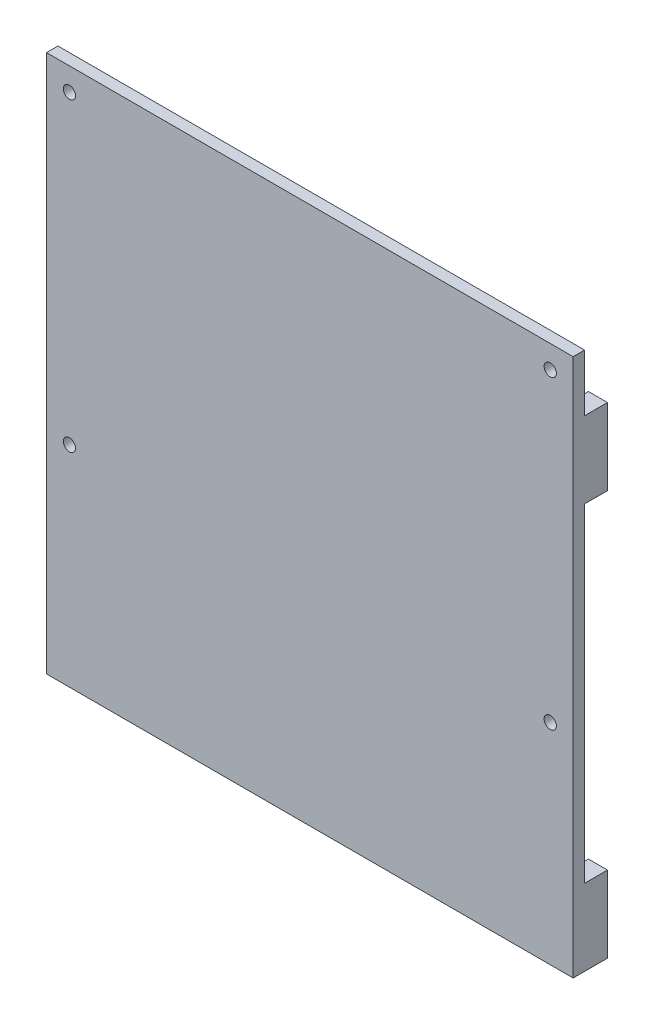
ISO-10303-21;
HEADER;
FILE_DESCRIPTION(('STEP AP214'),'2;1');
FILE_NAME('part.step','',(''),(''),'','','');
FILE_SCHEMA(('AUTOMOTIVE_DESIGN { 1 0 10303 214 1 1 1 1 }'));
ENDSEC;
DATA;
#1=APPLICATION_CONTEXT('core data for automotive mechanical design processes');
#2=APPLICATION_PROTOCOL_DEFINITION('international standard','automotive_design',2000,#1);
#3=PRODUCT_CONTEXT('',#1,'mechanical');
#4=PRODUCT('Part','Part','',(#3));
#5=PRODUCT_RELATED_PRODUCT_CATEGORY('part','',(#4));
#6=PRODUCT_DEFINITION_FORMATION('','',#4);
#7=PRODUCT_DEFINITION_CONTEXT('part definition',#1,'design');
#8=PRODUCT_DEFINITION('design','',#6,#7);
#9=PRODUCT_DEFINITION_SHAPE('','',#8);
#10=(LENGTH_UNIT() NAMED_UNIT(*) SI_UNIT(.MILLI.,.METRE.));
#11=(NAMED_UNIT(*) PLANE_ANGLE_UNIT() SI_UNIT($,.RADIAN.));
#12=(NAMED_UNIT(*) SI_UNIT($,.STERADIAN.) SOLID_ANGLE_UNIT());
#13=UNCERTAINTY_MEASURE_WITH_UNIT(LENGTH_MEASURE(1.E-05),#10,'distance_accuracy_value','');
#14=(GEOMETRIC_REPRESENTATION_CONTEXT(3) GLOBAL_UNCERTAINTY_ASSIGNED_CONTEXT((#13)) GLOBAL_UNIT_ASSIGNED_CONTEXT((#10,
#11,#12)) REPRESENTATION_CONTEXT('',''));
#15=CARTESIAN_POINT('',(0.,0.,0.));
#16=DIRECTION('',(0.,0.,1.));
#17=DIRECTION('',(1.,0.,0.));
#18=AXIS2_PLACEMENT_3D('',#15,#16,#17);
#19=CARTESIAN_POINT('',(0.,0.,0.));
#20=DIRECTION('',(0.,0.,1.));
#21=DIRECTION('',(1.,0.,0.));
#22=AXIS2_PLACEMENT_3D('',#19,#20,#21);
#23=PLANE('',#22);
#24=CARTESIAN_POINT('',(-48.1611570247934,18.3756022572227,0.));
#25=DIRECTION('',(0.,0.,1.));
#26=DIRECTION('',(1.,0.,0.));
#27=AXIS2_PLACEMENT_3D('',#24,#25,#26);
#28=CIRCLE('',#27,1.6);
#29=CARTESIAN_POINT('',(-46.5611570247934,18.3756022572227,0.));
#30=VERTEX_POINT('',#29);
#31=EDGE_CURVE('E341',#30,#30,#28,.T.);
#32=ORIENTED_EDGE('',*,*,#31,.T.);
#33=EDGE_LOOP('',(#32));
#34=FACE_BOUND('',#33,.T.);
#35=CARTESIAN_POINT('',(77.8388429752066,18.3756022572227,0.));
#36=DIRECTION('',(0.,0.,1.));
#37=DIRECTION('',(1.,0.,0.));
#38=AXIS2_PLACEMENT_3D('',#35,#36,#37);
#39=CIRCLE('',#38,1.6);
#40=CARTESIAN_POINT('',(79.4388429752066,18.3756022572227,0.));
#41=VERTEX_POINT('',#40);
#42=EDGE_CURVE('E333',#41,#41,#39,.T.);
#43=ORIENTED_EDGE('',*,*,#42,.T.);
#44=EDGE_LOOP('',(#43));
#45=FACE_BOUND('',#44,.T.);
#46=CARTESIAN_POINT('',(-48.1611570247934,-61.6243977427773,0.));
#47=DIRECTION('',(0.,0.,1.));
#48=DIRECTION('',(1.,0.,0.));
#49=AXIS2_PLACEMENT_3D('',#46,#47,#48);
#50=CIRCLE('',#49,1.6);
#51=CARTESIAN_POINT('',(-46.5611570247934,-61.6243977427773,0.));
#52=VERTEX_POINT('',#51);
#53=EDGE_CURVE('E325',#52,#52,#50,.T.);
#54=ORIENTED_EDGE('',*,*,#53,.T.);
#55=EDGE_LOOP('',(#54));
#56=FACE_BOUND('',#55,.T.);
#57=CARTESIAN_POINT('',(77.8388429752066,-61.6243977427773,0.));
#58=DIRECTION('',(0.,0.,1.));
#59=DIRECTION('',(1.,0.,0.));
#60=AXIS2_PLACEMENT_3D('',#57,#58,#59);
#61=CIRCLE('',#60,1.60000000000001);
#62=CARTESIAN_POINT('',(79.4388429752066,-61.6243977427773,0.));
#63=VERTEX_POINT('',#62);
#64=EDGE_CURVE('E320',#63,#63,#61,.T.);
#65=ORIENTED_EDGE('',*,*,#64,.T.);
#66=EDGE_LOOP('',(#65));
#67=FACE_BOUND('',#66,.T.);
#68=DIRECTION('',(1.,0.,0.));
#69=VECTOR('',#68,1.);
#70=CARTESIAN_POINT('',(83.8388429752066,9.4652357950889,0.));
#71=LINE('',#70,#69);
#72=CARTESIAN_POINT('',(78.8388429752066,9.4652357950889,0.));
#73=VERTEX_POINT('',#72);
#74=CARTESIAN_POINT('',(83.8388429752066,9.4652357950889,0.));
#75=VERTEX_POINT('',#74);
#76=EDGE_CURVE('E61',#73,#75,#71,.T.);
#77=ORIENTED_EDGE('',*,*,#76,.F.);
#78=DIRECTION('',(0.,1.,0.));
#79=VECTOR('',#78,1.);
#80=CARTESIAN_POINT('',(78.8388429752066,9.4652357950889,0.));
#81=LINE('',#80,#79);
#82=CARTESIAN_POINT('',(78.8388429752066,-10.5347642049111,0.));
#83=VERTEX_POINT('',#82);
#84=EDGE_CURVE('E236',#83,#73,#81,.T.);
#85=ORIENTED_EDGE('',*,*,#84,.F.);
#86=DIRECTION('',(-1.,0.,0.));
#87=VECTOR('',#86,1.);
#88=CARTESIAN_POINT('',(83.8388429752066,-10.5347642049111,0.));
#89=LINE('',#88,#87);
#90=CARTESIAN_POINT('',(83.8388429752066,-10.5347642049111,0.));
#91=VERTEX_POINT('',#90);
#92=EDGE_CURVE('E240',#91,#83,#89,.T.);
#93=ORIENTED_EDGE('',*,*,#92,.F.);
#94=DIRECTION('',(0.,1.,0.));
#95=VECTOR('',#94,1.);
#96=CARTESIAN_POINT('',(83.8388429752066,24.3756022572227,0.));
#97=LINE('',#96,#95);
#98=CARTESIAN_POINT('',(83.8388429752066,-96.6243977427773,0.));
#99=VERTEX_POINT('',#98);
#100=EDGE_CURVE('E378',#99,#91,#97,.T.);
#101=ORIENTED_EDGE('',*,*,#100,.F.);
#102=DIRECTION('',(1.,0.,0.));
#103=VECTOR('',#102,1.);
#104=CARTESIAN_POINT('',(83.8388429752066,-96.6243977427773,0.));
#105=LINE('',#104,#103);
#106=CARTESIAN_POINT('',(78.8388429752066,-96.6243977427773,0.));
#107=VERTEX_POINT('',#106);
#108=EDGE_CURVE('E293',#107,#99,#105,.T.);
#109=ORIENTED_EDGE('',*,*,#108,.F.);
#110=DIRECTION('',(0.,1.,0.));
#111=VECTOR('',#110,1.);
#112=CARTESIAN_POINT('',(78.8388429752066,-96.6243977427773,0.));
#113=LINE('',#112,#111);
#114=CARTESIAN_POINT('',(78.8388429752066,-116.624397742777,0.));
#115=VERTEX_POINT('',#114);
#116=EDGE_CURVE('E244',#115,#107,#113,.T.);
#117=ORIENTED_EDGE('',*,*,#116,.F.);
#118=DIRECTION('',(1.,0.,0.));
#119=VECTOR('',#118,1.);
#120=CARTESIAN_POINT('',(-54.1611570247934,-116.624397742777,0.));
#121=LINE('',#120,#119);
#122=CARTESIAN_POINT('',(-49.1611570247934,-116.624397742777,0.));
#123=VERTEX_POINT('',#122);
#124=EDGE_CURVE('E371',#123,#115,#121,.T.);
#125=ORIENTED_EDGE('',*,*,#124,.F.);
#126=DIRECTION('',(0.,-1.,0.));
#127=VECTOR('',#126,1.);
#128=CARTESIAN_POINT('',(-49.1611570247934,-96.6243977427773,0.));
#129=LINE('',#128,#127);
#130=CARTESIAN_POINT('',(-49.1611570247934,-96.6243977427773,0.));
#131=VERTEX_POINT('',#130);
#132=EDGE_CURVE('E268',#131,#123,#129,.T.);
#133=ORIENTED_EDGE('',*,*,#132,.F.);
#134=DIRECTION('',(1.,0.,0.));
#135=VECTOR('',#134,1.);
#136=CARTESIAN_POINT('',(-54.1611570247934,-96.6243977427773,0.));
#137=LINE('',#136,#135);
#138=CARTESIAN_POINT('',(-54.1611570247934,-96.6243977427773,0.));
#139=VERTEX_POINT('',#138);
#140=EDGE_CURVE('E221',#139,#131,#137,.T.);
#141=ORIENTED_EDGE('',*,*,#140,.F.);
#142=DIRECTION('',(0.,-1.,0.));
#143=VECTOR('',#142,1.);
#144=CARTESIAN_POINT('',(-54.1611570247934,24.3756022572227,0.));
#145=LINE('',#144,#143);
#146=CARTESIAN_POINT('',(-54.1611570247934,-10.5347642049111,0.));
#147=VERTEX_POINT('',#146);
#148=EDGE_CURVE('E349',#147,#139,#145,.T.);
#149=ORIENTED_EDGE('',*,*,#148,.F.);
#150=DIRECTION('',(-1.,0.,0.));
#151=VECTOR('',#150,1.);
#152=CARTESIAN_POINT('',(-54.1611570247934,-10.5347642049111,0.));
#153=LINE('',#152,#151);
#154=CARTESIAN_POINT('',(-49.1611570247934,-10.5347642049111,0.));
#155=VERTEX_POINT('',#154);
#156=EDGE_CURVE('E68',#155,#147,#153,.T.);
#157=ORIENTED_EDGE('',*,*,#156,.F.);
#158=DIRECTION('',(0.,-1.,0.));
#159=VECTOR('',#158,1.);
#160=CARTESIAN_POINT('',(-49.1611570247934,9.46523579508891,0.));
#161=LINE('',#160,#159);
#162=CARTESIAN_POINT('',(-49.1611570247934,9.46523579508891,0.));
#163=VERTEX_POINT('',#162);
#164=EDGE_CURVE('E166',#163,#155,#161,.T.);
#165=ORIENTED_EDGE('',*,*,#164,.F.);
#166=DIRECTION('',(1.,0.,0.));
#167=VECTOR('',#166,1.);
#168=CARTESIAN_POINT('',(-54.1611570247934,9.46523579508892,0.));
#169=LINE('',#168,#167);
#170=CARTESIAN_POINT('',(-54.1611570247934,9.46523579508892,0.));
#171=VERTEX_POINT('',#170);
#172=EDGE_CURVE('E169',#171,#163,#169,.T.);
#173=ORIENTED_EDGE('',*,*,#172,.F.);
#174=CARTESIAN_POINT('',(-54.1611570247934,24.3756022572227,0.));
#175=VERTEX_POINT('',#174);
#176=EDGE_CURVE('E368',#175,#171,#145,.T.);
#177=ORIENTED_EDGE('',*,*,#176,.F.);
#178=DIRECTION('',(-1.,0.,0.));
#179=VECTOR('',#178,1.);
#180=CARTESIAN_POINT('',(-54.1611570247934,24.3756022572227,0.));
#181=LINE('',#180,#179);
#182=CARTESIAN_POINT('',(83.8388429752066,24.3756022572227,0.));
#183=VERTEX_POINT('',#182);
#184=EDGE_CURVE('E358',#183,#175,#181,.T.);
#185=ORIENTED_EDGE('',*,*,#184,.F.);
#186=EDGE_CURVE('E375',#75,#183,#97,.T.);
#187=ORIENTED_EDGE('',*,*,#186,.F.);
#188=EDGE_LOOP('',(#77,#85,#93,#101,#109,#117,#125,#133,#141,#149,#157,#165,#173,#177,#185,#187));
#189=FACE_BOUND('',#188,.T.);
#190=ADVANCED_FACE('F45',(#34,#45,#56,#67,#189),#23,.F.);
#191=CARTESIAN_POINT('',(0.,0.,3.));
#192=DIRECTION('',(0.,0.,1.));
#193=DIRECTION('',(1.,0.,0.));
#194=AXIS2_PLACEMENT_3D('',#191,#192,#193);
#195=PLANE('',#194);
#196=CARTESIAN_POINT('',(-48.1611570247934,-61.6243977427773,3.));
#197=DIRECTION('',(0.,0.,1.));
#198=DIRECTION('',(1.,0.,0.));
#199=AXIS2_PLACEMENT_3D('',#196,#197,#198);
#200=CIRCLE('',#199,1.6);
#201=CARTESIAN_POINT('',(-46.5611570247934,-61.6243977427773,3.));
#202=VERTEX_POINT('',#201);
#203=EDGE_CURVE('E329',#202,#202,#200,.T.);
#204=ORIENTED_EDGE('',*,*,#203,.F.);
#205=EDGE_LOOP('',(#204));
#206=FACE_BOUND('',#205,.T.);
#207=CARTESIAN_POINT('',(-48.1611570247934,18.3756022572227,3.));
#208=DIRECTION('',(0.,0.,1.));
#209=DIRECTION('',(1.,0.,0.));
#210=AXIS2_PLACEMENT_3D('',#207,#208,#209);
#211=CIRCLE('',#210,1.6);
#212=CARTESIAN_POINT('',(-46.5611570247934,18.3756022572227,3.));
#213=VERTEX_POINT('',#212);
#214=EDGE_CURVE('E345',#213,#213,#211,.T.);
#215=ORIENTED_EDGE('',*,*,#214,.F.);
#216=EDGE_LOOP('',(#215));
#217=FACE_BOUND('',#216,.T.);
#218=DIRECTION('',(0.,-1.,0.));
#219=VECTOR('',#218,1.);
#220=CARTESIAN_POINT('',(-54.1611570247934,24.3756022572227,3.));
#221=LINE('',#220,#219);
#222=CARTESIAN_POINT('',(-54.1611570247934,24.3756022572227,3.));
#223=VERTEX_POINT('',#222);
#224=CARTESIAN_POINT('',(-54.1611570247934,-116.624397742777,3.));
#225=VERTEX_POINT('',#224);
#226=EDGE_CURVE('E353',#223,#225,#221,.T.);
#227=ORIENTED_EDGE('',*,*,#226,.T.);
#228=DIRECTION('',(1.,0.,0.));
#229=VECTOR('',#228,1.);
#230=CARTESIAN_POINT('',(-54.1611570247934,-116.624397742777,3.));
#231=LINE('',#230,#229);
#232=CARTESIAN_POINT('',(83.8388429752066,-116.624397742777,3.));
#233=VERTEX_POINT('',#232);
#234=EDGE_CURVE('E357',#225,#233,#231,.T.);
#235=ORIENTED_EDGE('',*,*,#234,.T.);
#236=DIRECTION('',(0.,1.,0.));
#237=VECTOR('',#236,1.);
#238=CARTESIAN_POINT('',(83.8388429752066,24.3756022572227,3.));
#239=LINE('',#238,#237);
#240=CARTESIAN_POINT('',(83.8388429752066,24.3756022572227,3.));
#241=VERTEX_POINT('',#240);
#242=EDGE_CURVE('E361',#233,#241,#239,.T.);
#243=ORIENTED_EDGE('',*,*,#242,.T.);
#244=DIRECTION('',(-1.,0.,0.));
#245=VECTOR('',#244,1.);
#246=CARTESIAN_POINT('',(-54.1611570247934,24.3756022572227,3.));
#247=LINE('',#246,#245);
#248=EDGE_CURVE('E364',#241,#223,#247,.T.);
#249=ORIENTED_EDGE('',*,*,#248,.T.);
#250=EDGE_LOOP('',(#227,#235,#243,#249));
#251=FACE_BOUND('',#250,.T.);
#252=CARTESIAN_POINT('',(77.8388429752066,18.3756022572227,3.));
#253=DIRECTION('',(0.,0.,1.));
#254=DIRECTION('',(1.,0.,0.));
#255=AXIS2_PLACEMENT_3D('',#252,#253,#254);
#256=CIRCLE('',#255,1.6);
#257=CARTESIAN_POINT('',(79.4388429752066,18.3756022572227,3.));
#258=VERTEX_POINT('',#257);
#259=EDGE_CURVE('E337',#258,#258,#256,.T.);
#260=ORIENTED_EDGE('',*,*,#259,.F.);
#261=EDGE_LOOP('',(#260));
#262=FACE_BOUND('',#261,.T.);
#263=CARTESIAN_POINT('',(77.8388429752066,-61.6243977427773,3.));
#264=DIRECTION('',(0.,0.,1.));
#265=DIRECTION('',(1.,0.,0.));
#266=AXIS2_PLACEMENT_3D('',#263,#264,#265);
#267=CIRCLE('',#266,1.60000000000001);
#268=CARTESIAN_POINT('',(79.4388429752066,-61.6243977427773,3.));
#269=VERTEX_POINT('',#268);
#270=EDGE_CURVE('E321',#269,#269,#267,.T.);
#271=ORIENTED_EDGE('',*,*,#270,.F.);
#272=EDGE_LOOP('',(#271));
#273=FACE_BOUND('',#272,.T.);
#274=ADVANCED_FACE('F433',(#206,#217,#251,#262,#273),#195,.T.);
#275=CARTESIAN_POINT('',(-54.1611570247934,24.3756022572227,3.));
#276=DIRECTION('',(1.,0.,0.));
#277=DIRECTION('',(0.,1.,0.));
#278=AXIS2_PLACEMENT_3D('',#275,#276,#277);
#279=PLANE('',#278);
#280=ORIENTED_EDGE('',*,*,#176,.T.);
#281=DIRECTION('',(0.,0.,1.));
#282=VECTOR('',#281,1.);
#283=CARTESIAN_POINT('',(-54.1611570247934,9.46523579508892,-6.));
#284=LINE('',#283,#282);
#285=CARTESIAN_POINT('',(-54.1611570247934,9.46523579508892,-6.));
#286=VERTEX_POINT('',#285);
#287=EDGE_CURVE('E184',#286,#171,#284,.T.);
#288=ORIENTED_EDGE('',*,*,#287,.F.);
#289=DIRECTION('',(0.,1.,0.));
#290=VECTOR('',#289,1.);
#291=CARTESIAN_POINT('',(-54.1611570247934,9.46523579508892,-6.));
#292=LINE('',#291,#290);
#293=CARTESIAN_POINT('',(-54.1611570247934,-10.5347642049111,-6.));
#294=VERTEX_POINT('',#293);
#295=EDGE_CURVE('E204',#294,#286,#292,.T.);
#296=ORIENTED_EDGE('',*,*,#295,.F.);
#297=DIRECTION('',(0.,0.,1.));
#298=VECTOR('',#297,1.);
#299=CARTESIAN_POINT('',(-54.1611570247934,-10.5347642049111,-6.));
#300=LINE('',#299,#298);
#301=EDGE_CURVE('E195',#294,#147,#300,.T.);
#302=ORIENTED_EDGE('',*,*,#301,.T.);
#303=ORIENTED_EDGE('',*,*,#148,.T.);
#304=DIRECTION('',(0.,0.,1.));
#305=VECTOR('',#304,1.);
#306=CARTESIAN_POINT('',(-54.1611570247934,-96.6243977427773,-6.));
#307=LINE('',#306,#305);
#308=CARTESIAN_POINT('',(-54.1611570247934,-96.6243977427773,-6.));
#309=VERTEX_POINT('',#308);
#310=EDGE_CURVE('E186',#309,#139,#307,.T.);
#311=ORIENTED_EDGE('',*,*,#310,.F.);
#312=DIRECTION('',(0.,1.,0.));
#313=VECTOR('',#312,1.);
#314=CARTESIAN_POINT('',(-54.1611570247934,-96.6243977427773,-6.));
#315=LINE('',#314,#313);
#316=CARTESIAN_POINT('',(-54.1611570247934,-116.624397742777,-6.));
#317=VERTEX_POINT('',#316);
#318=EDGE_CURVE('E272',#317,#309,#315,.T.);
#319=ORIENTED_EDGE('',*,*,#318,.F.);
#320=DIRECTION('',(0.,0.,-1.));
#321=VECTOR('',#320,1.);
#322=CARTESIAN_POINT('',(-54.1611570247934,-116.624397742777,3.));
#323=LINE('',#322,#321);
#324=EDGE_CURVE('E11',#225,#317,#323,.T.);
#325=ORIENTED_EDGE('',*,*,#324,.F.);
#326=ORIENTED_EDGE('',*,*,#226,.F.);
#327=DIRECTION('',(0.,0.,-1.));
#328=VECTOR('',#327,1.);
#329=CARTESIAN_POINT('',(-54.1611570247934,24.3756022572227,3.));
#330=LINE('',#329,#328);
#331=EDGE_CURVE('E367',#223,#175,#330,.T.);
#332=ORIENTED_EDGE('',*,*,#331,.T.);
#333=EDGE_LOOP('',(#280,#288,#296,#302,#303,#311,#319,#325,#326,#332));
#334=FACE_BOUND('',#333,.T.);
#335=ADVANCED_FACE('F47',(#334),#279,.F.);
#336=CARTESIAN_POINT('',(-54.1611570247934,-116.624397742777,3.));
#337=DIRECTION('',(0.,1.,0.));
#338=DIRECTION('',(0.,0.,1.));
#339=AXIS2_PLACEMENT_3D('',#336,#337,#338);
#340=PLANE('',#339);
#341=ORIENTED_EDGE('',*,*,#324,.T.);
#342=DIRECTION('',(-1.,0.,0.));
#343=VECTOR('',#342,1.);
#344=CARTESIAN_POINT('',(-54.1611570247934,-116.624397742777,-6.));
#345=LINE('',#344,#343);
#346=CARTESIAN_POINT('',(-49.1611570247934,-116.624397742777,-6.));
#347=VERTEX_POINT('',#346);
#348=EDGE_CURVE('E267',#347,#317,#345,.T.);
#349=ORIENTED_EDGE('',*,*,#348,.F.);
#350=DIRECTION('',(0.,0.,1.));
#351=VECTOR('',#350,1.);
#352=CARTESIAN_POINT('',(-49.1611570247934,-116.624397742777,-6.));
#353=LINE('',#352,#351);
#354=EDGE_CURVE('E263',#347,#123,#353,.T.);
#355=ORIENTED_EDGE('',*,*,#354,.T.);
#356=ORIENTED_EDGE('',*,*,#124,.T.);
#357=DIRECTION('',(0.,0.,1.));
#358=VECTOR('',#357,1.);
#359=CARTESIAN_POINT('',(78.8388429752066,-116.624397742777,-6.));
#360=LINE('',#359,#358);
#361=CARTESIAN_POINT('',(78.8388429752066,-116.624397742777,-6.));
#362=VERTEX_POINT('',#361);
#363=EDGE_CURVE('E316',#362,#115,#360,.T.);
#364=ORIENTED_EDGE('',*,*,#363,.F.);
#365=DIRECTION('',(-1.,0.,0.));
#366=VECTOR('',#365,1.);
#367=CARTESIAN_POINT('',(83.8388429752066,-116.624397742777,-6.));
#368=LINE('',#367,#366);
#369=CARTESIAN_POINT('',(83.8388429752066,-116.624397742777,-6.));
#370=VERTEX_POINT('',#369);
#371=EDGE_CURVE('E292',#370,#362,#368,.T.);
#372=ORIENTED_EDGE('',*,*,#371,.F.);
#373=DIRECTION('',(0.,0.,-1.));
#374=VECTOR('',#373,1.);
#375=CARTESIAN_POINT('',(83.8388429752066,-116.624397742777,3.));
#376=LINE('',#375,#374);
#377=EDGE_CURVE('E54',#233,#370,#376,.T.);
#378=ORIENTED_EDGE('',*,*,#377,.F.);
#379=ORIENTED_EDGE('',*,*,#234,.F.);
#380=EDGE_LOOP('',(#341,#349,#355,#356,#364,#372,#378,#379));
#381=FACE_BOUND('',#380,.T.);
#382=ADVANCED_FACE('F397',(#381),#340,.F.);
#383=CARTESIAN_POINT('',(83.8388429752066,24.3756022572227,3.));
#384=DIRECTION('',(-1.,0.,0.));
#385=DIRECTION('',(0.,-1.,0.));
#386=AXIS2_PLACEMENT_3D('',#383,#384,#385);
#387=PLANE('',#386);
#388=ORIENTED_EDGE('',*,*,#377,.T.);
#389=DIRECTION('',(0.,-1.,0.));
#390=VECTOR('',#389,1.);
#391=CARTESIAN_POINT('',(83.8388429752066,-96.6243977427773,-6.));
#392=LINE('',#391,#390);
#393=CARTESIAN_POINT('',(83.8388429752066,-96.6243977427773,-6.));
#394=VERTEX_POINT('',#393);
#395=EDGE_CURVE('E288',#394,#370,#392,.T.);
#396=ORIENTED_EDGE('',*,*,#395,.F.);
#397=DIRECTION('',(0.,0.,1.));
#398=VECTOR('',#397,1.);
#399=CARTESIAN_POINT('',(83.8388429752066,-96.6243977427773,-6.));
#400=LINE('',#399,#398);
#401=EDGE_CURVE('E302',#394,#99,#400,.T.);
#402=ORIENTED_EDGE('',*,*,#401,.T.);
#403=ORIENTED_EDGE('',*,*,#100,.T.);
#404=DIRECTION('',(0.,0.,1.));
#405=VECTOR('',#404,1.);
#406=CARTESIAN_POINT('',(83.8388429752066,-10.5347642049111,-6.));
#407=LINE('',#406,#405);
#408=CARTESIAN_POINT('',(83.8388429752066,-10.5347642049111,-6.));
#409=VERTEX_POINT('',#408);
#410=EDGE_CURVE('E216',#409,#91,#407,.T.);
#411=ORIENTED_EDGE('',*,*,#410,.F.);
#412=DIRECTION('',(0.,-1.,0.));
#413=VECTOR('',#412,1.);
#414=CARTESIAN_POINT('',(83.8388429752066,9.4652357950889,-6.));
#415=LINE('',#414,#413);
#416=CARTESIAN_POINT('',(83.8388429752066,9.4652357950889,-6.));
#417=VERTEX_POINT('',#416);
#418=EDGE_CURVE('E237',#417,#409,#415,.T.);
#419=ORIENTED_EDGE('',*,*,#418,.F.);
#420=DIRECTION('',(0.,0.,1.));
#421=VECTOR('',#420,1.);
#422=CARTESIAN_POINT('',(83.8388429752066,9.4652357950889,-6.));
#423=LINE('',#422,#421);
#424=EDGE_CURVE('E229',#417,#75,#423,.T.);
#425=ORIENTED_EDGE('',*,*,#424,.T.);
#426=ORIENTED_EDGE('',*,*,#186,.T.);
#427=DIRECTION('',(0.,0.,-1.));
#428=VECTOR('',#427,1.);
#429=CARTESIAN_POINT('',(83.8388429752066,24.3756022572227,3.));
#430=LINE('',#429,#428);
#431=EDGE_CURVE('E384',#241,#183,#430,.T.);
#432=ORIENTED_EDGE('',*,*,#431,.F.);
#433=ORIENTED_EDGE('',*,*,#242,.F.);
#434=EDGE_LOOP('',(#388,#396,#402,#403,#411,#419,#425,#426,#432,#433));
#435=FACE_BOUND('',#434,.T.);
#436=ADVANCED_FACE('F393',(#435),#387,.F.);
#437=CARTESIAN_POINT('',(-54.1611570247934,24.3756022572227,3.));
#438=DIRECTION('',(0.,-1.,0.));
#439=DIRECTION('',(0.,0.,-1.));
#440=AXIS2_PLACEMENT_3D('',#437,#438,#439);
#441=PLANE('',#440);
#442=ORIENTED_EDGE('',*,*,#184,.T.);
#443=ORIENTED_EDGE('',*,*,#331,.F.);
#444=ORIENTED_EDGE('',*,*,#248,.F.);
#445=ORIENTED_EDGE('',*,*,#431,.T.);
#446=EDGE_LOOP('',(#442,#443,#444,#445));
#447=FACE_BOUND('',#446,.T.);
#448=ADVANCED_FACE('F446',(#447),#441,.F.);
#449=CARTESIAN_POINT('',(-48.1611570247934,18.3756022572227,3.));
#450=DIRECTION('',(0.,0.,-1.));
#451=DIRECTION('',(-1.,0.,0.));
#452=AXIS2_PLACEMENT_3D('',#449,#450,#451);
#453=CYLINDRICAL_SURFACE('',#452,1.6);
#454=ORIENTED_EDGE('',*,*,#214,.T.);
#455=EDGE_LOOP('',(#454));
#456=FACE_BOUND('',#455,.T.);
#457=ORIENTED_EDGE('',*,*,#31,.F.);
#458=EDGE_LOOP('',(#457));
#459=FACE_BOUND('',#458,.T.);
#460=ADVANCED_FACE('F449',(#456,#459),#453,.F.);
#461=CARTESIAN_POINT('',(77.8388429752066,18.3756022572227,3.));
#462=DIRECTION('',(0.,0.,-1.));
#463=DIRECTION('',(-1.,0.,0.));
#464=AXIS2_PLACEMENT_3D('',#461,#462,#463);
#465=CYLINDRICAL_SURFACE('',#464,1.6);
#466=ORIENTED_EDGE('',*,*,#259,.T.);
#467=EDGE_LOOP('',(#466));
#468=FACE_BOUND('',#467,.T.);
#469=ORIENTED_EDGE('',*,*,#42,.F.);
#470=EDGE_LOOP('',(#469));
#471=FACE_BOUND('',#470,.T.);
#472=ADVANCED_FACE('F494',(#468,#471),#465,.F.);
#473=CARTESIAN_POINT('',(-48.1611570247934,-61.6243977427773,3.));
#474=DIRECTION('',(0.,0.,-1.));
#475=DIRECTION('',(-1.,0.,0.));
#476=AXIS2_PLACEMENT_3D('',#473,#474,#475);
#477=CYLINDRICAL_SURFACE('',#476,1.6);
#478=ORIENTED_EDGE('',*,*,#203,.T.);
#479=EDGE_LOOP('',(#478));
#480=FACE_BOUND('',#479,.T.);
#481=ORIENTED_EDGE('',*,*,#53,.F.);
#482=EDGE_LOOP('',(#481));
#483=FACE_BOUND('',#482,.T.);
#484=ADVANCED_FACE('F487',(#480,#483),#477,.F.);
#485=CARTESIAN_POINT('',(77.8388429752066,-61.6243977427773,3.));
#486=DIRECTION('',(0.,0.,-1.));
#487=DIRECTION('',(-1.,0.,0.));
#488=AXIS2_PLACEMENT_3D('',#485,#486,#487);
#489=CYLINDRICAL_SURFACE('',#488,1.60000000000001);
#490=ORIENTED_EDGE('',*,*,#270,.T.);
#491=EDGE_LOOP('',(#490));
#492=FACE_BOUND('',#491,.T.);
#493=ORIENTED_EDGE('',*,*,#64,.F.);
#494=EDGE_LOOP('',(#493));
#495=FACE_BOUND('',#494,.T.);
#496=ADVANCED_FACE('F481',(#492,#495),#489,.F.);
#497=CARTESIAN_POINT('',(78.8388429752066,-96.6243977427773,-6.));
#498=DIRECTION('',(1.,0.,0.));
#499=DIRECTION('',(0.,0.,-1.));
#500=AXIS2_PLACEMENT_3D('',#497,#498,#499);
#501=PLANE('',#500);
#502=ORIENTED_EDGE('',*,*,#116,.T.);
#503=DIRECTION('',(0.,0.,1.));
#504=VECTOR('',#503,1.);
#505=CARTESIAN_POINT('',(78.8388429752066,-96.6243977427773,-6.));
#506=LINE('',#505,#504);
#507=CARTESIAN_POINT('',(78.8388429752066,-96.6243977427773,-6.));
#508=VERTEX_POINT('',#507);
#509=EDGE_CURVE('E312',#508,#107,#506,.T.);
#510=ORIENTED_EDGE('',*,*,#509,.F.);
#511=DIRECTION('',(0.,1.,0.));
#512=VECTOR('',#511,1.);
#513=CARTESIAN_POINT('',(78.8388429752066,-96.6243977427773,-6.));
#514=LINE('',#513,#512);
#515=EDGE_CURVE('E296',#362,#508,#514,.T.);
#516=ORIENTED_EDGE('',*,*,#515,.F.);
#517=ORIENTED_EDGE('',*,*,#363,.T.);
#518=EDGE_LOOP('',(#502,#510,#516,#517));
#519=FACE_BOUND('',#518,.T.);
#520=ADVANCED_FACE('F479',(#519),#501,.F.);
#521=CARTESIAN_POINT('',(83.8388429752066,-96.6243977427773,-6.));
#522=DIRECTION('',(0.,-1.,0.));
#523=DIRECTION('',(0.,0.,-1.));
#524=AXIS2_PLACEMENT_3D('',#521,#522,#523);
#525=PLANE('',#524);
#526=ORIENTED_EDGE('',*,*,#108,.T.);
#527=ORIENTED_EDGE('',*,*,#401,.F.);
#528=DIRECTION('',(1.,0.,0.));
#529=VECTOR('',#528,1.);
#530=CARTESIAN_POINT('',(83.8388429752066,-96.6243977427773,-6.));
#531=LINE('',#530,#529);
#532=EDGE_CURVE('E299',#508,#394,#531,.T.);
#533=ORIENTED_EDGE('',*,*,#532,.F.);
#534=ORIENTED_EDGE('',*,*,#509,.T.);
#535=EDGE_LOOP('',(#526,#527,#533,#534));
#536=FACE_BOUND('',#535,.T.);
#537=ADVANCED_FACE('F405',(#536),#525,.F.);
#538=CARTESIAN_POINT('',(0.,0.,-6.));
#539=DIRECTION('',(0.,0.,-1.));
#540=DIRECTION('',(-1.,0.,0.));
#541=AXIS2_PLACEMENT_3D('',#538,#539,#540);
#542=PLANE('',#541);
#543=ORIENTED_EDGE('',*,*,#395,.T.);
#544=ORIENTED_EDGE('',*,*,#371,.T.);
#545=ORIENTED_EDGE('',*,*,#515,.T.);
#546=ORIENTED_EDGE('',*,*,#532,.T.);
#547=EDGE_LOOP('',(#543,#544,#545,#546));
#548=FACE_BOUND('',#547,.T.);
#549=ADVANCED_FACE('F400',(#548),#542,.T.);
#550=CARTESIAN_POINT('',(-54.1611570247934,9.46523579508892,-6.));
#551=DIRECTION('',(0.,-1.,0.));
#552=DIRECTION('',(1.,0.,0.));
#553=AXIS2_PLACEMENT_3D('',#550,#551,#552);
#554=PLANE('',#553);
#555=ORIENTED_EDGE('',*,*,#172,.T.);
#556=DIRECTION('',(0.,0.,1.));
#557=VECTOR('',#556,1.);
#558=CARTESIAN_POINT('',(-49.1611570247934,9.46523579508891,-6.));
#559=LINE('',#558,#557);
#560=CARTESIAN_POINT('',(-49.1611570247934,9.46523579508891,-6.));
#561=VERTEX_POINT('',#560);
#562=EDGE_CURVE('E181',#561,#163,#559,.T.);
#563=ORIENTED_EDGE('',*,*,#562,.F.);
#564=DIRECTION('',(1.,0.,0.));
#565=VECTOR('',#564,1.);
#566=CARTESIAN_POINT('',(-54.1611570247934,9.46523579508892,-6.));
#567=LINE('',#566,#565);
#568=EDGE_CURVE('E210',#286,#561,#567,.T.);
#569=ORIENTED_EDGE('',*,*,#568,.F.);
#570=ORIENTED_EDGE('',*,*,#287,.T.);
#571=EDGE_LOOP('',(#555,#563,#569,#570));
#572=FACE_BOUND('',#571,.T.);
#573=ADVANCED_FACE('F180',(#572),#554,.F.);
#574=CARTESIAN_POINT('',(-49.1611570247934,9.46523579508891,-6.));
#575=DIRECTION('',(-1.,0.,0.));
#576=DIRECTION('',(0.,0.,1.));
#577=AXIS2_PLACEMENT_3D('',#574,#575,#576);
#578=PLANE('',#577);
#579=ORIENTED_EDGE('',*,*,#164,.T.);
#580=DIRECTION('',(0.,0.,1.));
#581=VECTOR('',#580,1.);
#582=CARTESIAN_POINT('',(-49.1611570247934,-10.5347642049111,-6.));
#583=LINE('',#582,#581);
#584=CARTESIAN_POINT('',(-49.1611570247934,-10.5347642049111,-6.));
#585=VERTEX_POINT('',#584);
#586=EDGE_CURVE('E191',#585,#155,#583,.T.);
#587=ORIENTED_EDGE('',*,*,#586,.F.);
#588=DIRECTION('',(0.,-1.,0.));
#589=VECTOR('',#588,1.);
#590=CARTESIAN_POINT('',(-49.1611570247934,9.46523579508891,-6.));
#591=LINE('',#590,#589);
#592=EDGE_CURVE('E189',#561,#585,#591,.T.);
#593=ORIENTED_EDGE('',*,*,#592,.F.);
#594=ORIENTED_EDGE('',*,*,#562,.T.);
#595=EDGE_LOOP('',(#579,#587,#593,#594));
#596=FACE_BOUND('',#595,.T.);
#597=ADVANCED_FACE('F188',(#596),#578,.F.);
#598=CARTESIAN_POINT('',(-54.1611570247934,-10.5347642049111,-6.));
#599=DIRECTION('',(0.,1.,0.));
#600=DIRECTION('',(0.,0.,1.));
#601=AXIS2_PLACEMENT_3D('',#598,#599,#600);
#602=PLANE('',#601);
#603=ORIENTED_EDGE('',*,*,#156,.T.);
#604=ORIENTED_EDGE('',*,*,#301,.F.);
#605=DIRECTION('',(-1.,0.,0.));
#606=VECTOR('',#605,1.);
#607=CARTESIAN_POINT('',(-54.1611570247934,-10.5347642049111,-6.));
#608=LINE('',#607,#606);
#609=EDGE_CURVE('E202',#585,#294,#608,.T.);
#610=ORIENTED_EDGE('',*,*,#609,.F.);
#611=ORIENTED_EDGE('',*,*,#586,.T.);
#612=EDGE_LOOP('',(#603,#604,#610,#611));
#613=FACE_BOUND('',#612,.T.);
#614=ADVANCED_FACE('F592',(#613),#602,.F.);
#615=CARTESIAN_POINT('',(0.,0.,-6.));
#616=DIRECTION('',(0.,0.,1.));
#617=DIRECTION('',(1.,0.,0.));
#618=AXIS2_PLACEMENT_3D('',#615,#616,#617);
#619=PLANE('',#618);
#620=ORIENTED_EDGE('',*,*,#295,.T.);
#621=ORIENTED_EDGE('',*,*,#568,.T.);
#622=ORIENTED_EDGE('',*,*,#592,.T.);
#623=ORIENTED_EDGE('',*,*,#609,.T.);
#624=EDGE_LOOP('',(#620,#621,#622,#623));
#625=FACE_BOUND('',#624,.T.);
#626=ADVANCED_FACE('F601',(#625),#619,.F.);
#627=CARTESIAN_POINT('',(-54.1611570247934,-96.6243977427773,-6.));
#628=DIRECTION('',(0.,-1.,0.));
#629=DIRECTION('',(0.,0.,-1.));
#630=AXIS2_PLACEMENT_3D('',#627,#628,#629);
#631=PLANE('',#630);
#632=ORIENTED_EDGE('',*,*,#140,.T.);
#633=DIRECTION('',(0.,0.,1.));
#634=VECTOR('',#633,1.);
#635=CARTESIAN_POINT('',(-49.1611570247934,-96.6243977427773,-6.));
#636=LINE('',#635,#634);
#637=CARTESIAN_POINT('',(-49.1611570247934,-96.6243977427773,-6.));
#638=VERTEX_POINT('',#637);
#639=EDGE_CURVE('E259',#638,#131,#636,.T.);
#640=ORIENTED_EDGE('',*,*,#639,.F.);
#641=DIRECTION('',(1.,0.,0.));
#642=VECTOR('',#641,1.);
#643=CARTESIAN_POINT('',(-54.1611570247934,-96.6243977427773,-6.));
#644=LINE('',#643,#642);
#645=EDGE_CURVE('E282',#309,#638,#644,.T.);
#646=ORIENTED_EDGE('',*,*,#645,.F.);
#647=ORIENTED_EDGE('',*,*,#310,.T.);
#648=EDGE_LOOP('',(#632,#640,#646,#647));
#649=FACE_BOUND('',#648,.T.);
#650=ADVANCED_FACE('F474',(#649),#631,.F.);
#651=CARTESIAN_POINT('',(-49.1611570247934,-96.6243977427773,-6.));
#652=DIRECTION('',(-1.,0.,0.));
#653=DIRECTION('',(0.,-1.,0.));
#654=AXIS2_PLACEMENT_3D('',#651,#652,#653);
#655=PLANE('',#654);
#656=ORIENTED_EDGE('',*,*,#132,.T.);
#657=ORIENTED_EDGE('',*,*,#354,.F.);
#658=DIRECTION('',(0.,-1.,0.));
#659=VECTOR('',#658,1.);
#660=CARTESIAN_POINT('',(-49.1611570247934,-96.6243977427773,-6.));
#661=LINE('',#660,#659);
#662=EDGE_CURVE('E279',#638,#347,#661,.T.);
#663=ORIENTED_EDGE('',*,*,#662,.F.);
#664=ORIENTED_EDGE('',*,*,#639,.T.);
#665=EDGE_LOOP('',(#656,#657,#663,#664));
#666=FACE_BOUND('',#665,.T.);
#667=ADVANCED_FACE('F477',(#666),#655,.F.);
#668=CARTESIAN_POINT('',(0.,0.,-6.));
#669=DIRECTION('',(0.,0.,1.));
#670=DIRECTION('',(1.,0.,0.));
#671=AXIS2_PLACEMENT_3D('',#668,#669,#670);
#672=PLANE('',#671);
#673=ORIENTED_EDGE('',*,*,#318,.T.);
#674=ORIENTED_EDGE('',*,*,#645,.T.);
#675=ORIENTED_EDGE('',*,*,#662,.T.);
#676=ORIENTED_EDGE('',*,*,#348,.T.);
#677=EDGE_LOOP('',(#673,#674,#675,#676));
#678=FACE_BOUND('',#677,.T.);
#679=ADVANCED_FACE('F430',(#678),#672,.F.);
#680=CARTESIAN_POINT('',(83.8388429752066,-10.5347642049111,-6.));
#681=DIRECTION('',(0.,1.,0.));
#682=DIRECTION('',(0.,0.,1.));
#683=AXIS2_PLACEMENT_3D('',#680,#681,#682);
#684=PLANE('',#683);
#685=ORIENTED_EDGE('',*,*,#92,.T.);
#686=DIRECTION('',(0.,0.,1.));
#687=VECTOR('',#686,1.);
#688=CARTESIAN_POINT('',(78.8388429752066,-10.5347642049111,-6.));
#689=LINE('',#688,#687);
#690=CARTESIAN_POINT('',(78.8388429752066,-10.5347642049111,-6.));
#691=VERTEX_POINT('',#690);
#692=EDGE_CURVE('E220',#691,#83,#689,.T.);
#693=ORIENTED_EDGE('',*,*,#692,.F.);
#694=DIRECTION('',(-1.,0.,0.));
#695=VECTOR('',#694,1.);
#696=CARTESIAN_POINT('',(83.8388429752066,-10.5347642049111,-6.));
#697=LINE('',#696,#695);
#698=EDGE_CURVE('E250',#409,#691,#697,.T.);
#699=ORIENTED_EDGE('',*,*,#698,.F.);
#700=ORIENTED_EDGE('',*,*,#410,.T.);
#701=EDGE_LOOP('',(#685,#693,#699,#700));
#702=FACE_BOUND('',#701,.T.);
#703=ADVANCED_FACE('F411',(#702),#684,.F.);
#704=CARTESIAN_POINT('',(78.8388429752066,9.4652357950889,-6.));
#705=DIRECTION('',(1.,0.,0.));
#706=DIRECTION('',(0.,0.,-1.));
#707=AXIS2_PLACEMENT_3D('',#704,#705,#706);
#708=PLANE('',#707);
#709=ORIENTED_EDGE('',*,*,#84,.T.);
#710=DIRECTION('',(0.,0.,1.));
#711=VECTOR('',#710,1.);
#712=CARTESIAN_POINT('',(78.8388429752066,9.4652357950889,-6.));
#713=LINE('',#712,#711);
#714=CARTESIAN_POINT('',(78.8388429752066,9.4652357950889,-6.));
#715=VERTEX_POINT('',#714);
#716=EDGE_CURVE('E225',#715,#73,#713,.T.);
#717=ORIENTED_EDGE('',*,*,#716,.F.);
#718=DIRECTION('',(0.,1.,0.));
#719=VECTOR('',#718,1.);
#720=CARTESIAN_POINT('',(78.8388429752066,9.4652357950889,-6.));
#721=LINE('',#720,#719);
#722=EDGE_CURVE('E247',#691,#715,#721,.T.);
#723=ORIENTED_EDGE('',*,*,#722,.F.);
#724=ORIENTED_EDGE('',*,*,#692,.T.);
#725=EDGE_LOOP('',(#709,#717,#723,#724));
#726=FACE_BOUND('',#725,.T.);
#727=ADVANCED_FACE('F422',(#726),#708,.F.);
#728=CARTESIAN_POINT('',(83.8388429752066,9.4652357950889,-6.));
#729=DIRECTION('',(0.,-1.,0.));
#730=DIRECTION('',(0.,0.,-1.));
#731=AXIS2_PLACEMENT_3D('',#728,#729,#730);
#732=PLANE('',#731);
#733=ORIENTED_EDGE('',*,*,#76,.T.);
#734=ORIENTED_EDGE('',*,*,#424,.F.);
#735=DIRECTION('',(1.,0.,0.));
#736=VECTOR('',#735,1.);
#737=CARTESIAN_POINT('',(83.8388429752066,9.4652357950889,-6.));
#738=LINE('',#737,#736);
#739=EDGE_CURVE('E233',#715,#417,#738,.T.);
#740=ORIENTED_EDGE('',*,*,#739,.F.);
#741=ORIENTED_EDGE('',*,*,#716,.T.);
#742=EDGE_LOOP('',(#733,#734,#740,#741));
#743=FACE_BOUND('',#742,.T.);
#744=ADVANCED_FACE('F419',(#743),#732,.F.);
#745=CARTESIAN_POINT('',(0.,0.,-6.));
#746=DIRECTION('',(0.,0.,-1.));
#747=DIRECTION('',(-1.,0.,0.));
#748=AXIS2_PLACEMENT_3D('',#745,#746,#747);
#749=PLANE('',#748);
#750=ORIENTED_EDGE('',*,*,#418,.T.);
#751=ORIENTED_EDGE('',*,*,#698,.T.);
#752=ORIENTED_EDGE('',*,*,#722,.T.);
#753=ORIENTED_EDGE('',*,*,#739,.T.);
#754=EDGE_LOOP('',(#750,#751,#752,#753));
#755=FACE_BOUND('',#754,.T.);
#756=ADVANCED_FACE('F415',(#755),#749,.T.);
#757=CLOSED_SHELL('',(#190,#274,#335,#382,#436,#448,#460,#472,#484,#496,#520,#537,#549,#573,
#597,#614,#626,#650,#667,#679,#703,#727,#744,#756));
#758=MANIFOLD_SOLID_BREP('B2',#757);
#759=ADVANCED_BREP_SHAPE_REPRESENTATION('',(#18,#758),#14);
#760=SHAPE_DEFINITION_REPRESENTATION(#9,#759);
ENDSEC;
END-ISO-10303-21;
